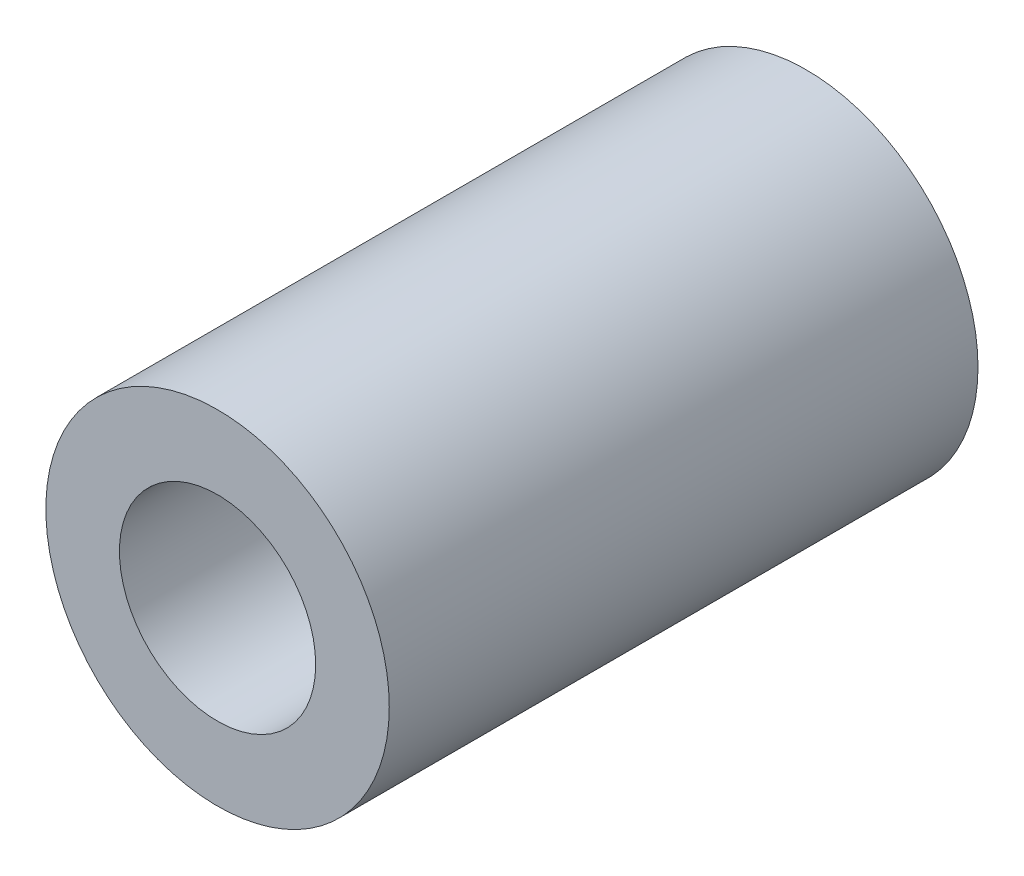
ISO-10303-21;
HEADER;
FILE_DESCRIPTION(('STEP AP214'),'2;1');
FILE_NAME('part.step','',(''),(''),'','','');
FILE_SCHEMA(('AUTOMOTIVE_DESIGN { 1 0 10303 214 1 1 1 1 }'));
ENDSEC;
DATA;
#1=APPLICATION_CONTEXT('core data for automotive mechanical design processes');
#2=APPLICATION_PROTOCOL_DEFINITION('international standard','automotive_design',2000,#1);
#3=PRODUCT_CONTEXT('',#1,'mechanical');
#4=PRODUCT('Part','Part','',(#3));
#5=PRODUCT_RELATED_PRODUCT_CATEGORY('part','',(#4));
#6=PRODUCT_DEFINITION_FORMATION('','',#4);
#7=PRODUCT_DEFINITION_CONTEXT('part definition',#1,'design');
#8=PRODUCT_DEFINITION('design','',#6,#7);
#9=PRODUCT_DEFINITION_SHAPE('','',#8);
#10=(LENGTH_UNIT() NAMED_UNIT(*) SI_UNIT(.MILLI.,.METRE.));
#11=(NAMED_UNIT(*) PLANE_ANGLE_UNIT() SI_UNIT($,.RADIAN.));
#12=(NAMED_UNIT(*) SI_UNIT($,.STERADIAN.) SOLID_ANGLE_UNIT());
#13=UNCERTAINTY_MEASURE_WITH_UNIT(LENGTH_MEASURE(1.E-05),#10,'distance_accuracy_value','');
#14=(GEOMETRIC_REPRESENTATION_CONTEXT(3) GLOBAL_UNCERTAINTY_ASSIGNED_CONTEXT((#13)) GLOBAL_UNIT_ASSIGNED_CONTEXT((#10,
#11,#12)) REPRESENTATION_CONTEXT('',''));
#15=CARTESIAN_POINT('',(0.,0.,0.));
#16=DIRECTION('',(0.,0.,1.));
#17=DIRECTION('',(1.,0.,0.));
#18=AXIS2_PLACEMENT_3D('',#15,#16,#17);
#19=CARTESIAN_POINT('',(-9.72027957543627,3.39160826861862,-1.77817459305202));
#20=DIRECTION('',(0.,0.,1.));
#21=DIRECTION('',(1.,0.,0.));
#22=AXIS2_PLACEMENT_3D('',#19,#20,#21);
#23=CYLINDRICAL_SURFACE('',#22,1.);
#24=CARTESIAN_POINT('',(-9.72027957543627,3.39160826861862,6.));
#25=DIRECTION('',(0.,0.,1.));
#26=DIRECTION('',(1.,0.,0.));
#27=AXIS2_PLACEMENT_3D('',#24,#25,#26);
#28=CIRCLE('',#27,1.);
#29=CARTESIAN_POINT('',(-8.72027957543627,3.39160826861862,6.));
#30=VERTEX_POINT('',#29);
#31=EDGE_CURVE('E18',#30,#30,#28,.T.);
#32=ORIENTED_EDGE('',*,*,#31,.T.);
#33=EDGE_LOOP('',(#32));
#34=FACE_BOUND('',#33,.T.);
#35=CARTESIAN_POINT('',(-9.72027957543627,3.39160826861862,0.));
#36=DIRECTION('',(0.,0.,1.));
#37=DIRECTION('',(1.,0.,0.));
#38=AXIS2_PLACEMENT_3D('',#35,#36,#37);
#39=CIRCLE('',#38,1.);
#40=CARTESIAN_POINT('',(-8.72027957543627,3.39160826861862,0.));
#41=VERTEX_POINT('',#40);
#42=EDGE_CURVE('E27',#41,#41,#39,.T.);
#43=ORIENTED_EDGE('',*,*,#42,.F.);
#44=EDGE_LOOP('',(#43));
#45=FACE_BOUND('',#44,.T.);
#46=ADVANCED_FACE('F15',(#34,#45),#23,.F.);
#47=CARTESIAN_POINT('',(-9.72027957543627,3.39160826861862,6.));
#48=DIRECTION('',(0.,0.,-1.));
#49=DIRECTION('',(-1.,0.,0.));
#50=AXIS2_PLACEMENT_3D('',#47,#48,#49);
#51=PLANE('',#50);
#52=CARTESIAN_POINT('',(-9.72027957543627,3.39160826861862,6.));
#53=DIRECTION('',(0.,0.,1.));
#54=DIRECTION('',(1.,0.,0.));
#55=AXIS2_PLACEMENT_3D('',#52,#53,#54);
#56=CIRCLE('',#55,1.75);
#57=CARTESIAN_POINT('',(-7.97027957543627,3.39160826861862,6.));
#58=VERTEX_POINT('',#57);
#59=EDGE_CURVE('E22',#58,#58,#56,.F.);
#60=ORIENTED_EDGE('',*,*,#59,.F.);
#61=EDGE_LOOP('',(#60));
#62=FACE_BOUND('',#61,.T.);
#63=ORIENTED_EDGE('',*,*,#31,.F.);
#64=EDGE_LOOP('',(#63));
#65=FACE_BOUND('',#64,.T.);
#66=ADVANCED_FACE('F37',(#62,#65),#51,.F.);
#67=CARTESIAN_POINT('',(-9.72027957543627,3.39160826861862,0.));
#68=DIRECTION('',(0.,0.,-1.));
#69=DIRECTION('',(-1.,0.,0.));
#70=AXIS2_PLACEMENT_3D('',#67,#68,#69);
#71=PLANE('',#70);
#72=CARTESIAN_POINT('',(-9.72027957543627,3.39160826861862,0.));
#73=DIRECTION('',(0.,0.,1.));
#74=DIRECTION('',(1.,0.,0.));
#75=AXIS2_PLACEMENT_3D('',#72,#73,#74);
#76=CIRCLE('',#75,1.75);
#77=CARTESIAN_POINT('',(-7.97027957543627,3.39160826861862,0.));
#78=VERTEX_POINT('',#77);
#79=EDGE_CURVE('E10',#78,#78,#76,.T.);
#80=ORIENTED_EDGE('',*,*,#79,.F.);
#81=EDGE_LOOP('',(#80));
#82=FACE_BOUND('',#81,.T.);
#83=ORIENTED_EDGE('',*,*,#42,.T.);
#84=EDGE_LOOP('',(#83));
#85=FACE_BOUND('',#84,.T.);
#86=ADVANCED_FACE('F39',(#82,#85),#71,.T.);
#87=CARTESIAN_POINT('',(-9.72027957543627,3.39160826861862,0.));
#88=DIRECTION('',(0.,0.,1.));
#89=DIRECTION('',(1.,0.,0.));
#90=AXIS2_PLACEMENT_3D('',#87,#88,#89);
#91=CYLINDRICAL_SURFACE('',#90,1.75);
#92=ORIENTED_EDGE('',*,*,#79,.T.);
#93=EDGE_LOOP('',(#92));
#94=FACE_BOUND('',#93,.T.);
#95=ORIENTED_EDGE('',*,*,#59,.T.);
#96=EDGE_LOOP('',(#95));
#97=FACE_BOUND('',#96,.T.);
#98=ADVANCED_FACE('F47',(#94,#97),#91,.T.);
#99=CLOSED_SHELL('',(#46,#66,#86,#98));
#100=MANIFOLD_SOLID_BREP('B1',#99);
#101=ADVANCED_BREP_SHAPE_REPRESENTATION('',(#18,#100),#14);
#102=SHAPE_DEFINITION_REPRESENTATION(#9,#101);
ENDSEC;
END-ISO-10303-21;
